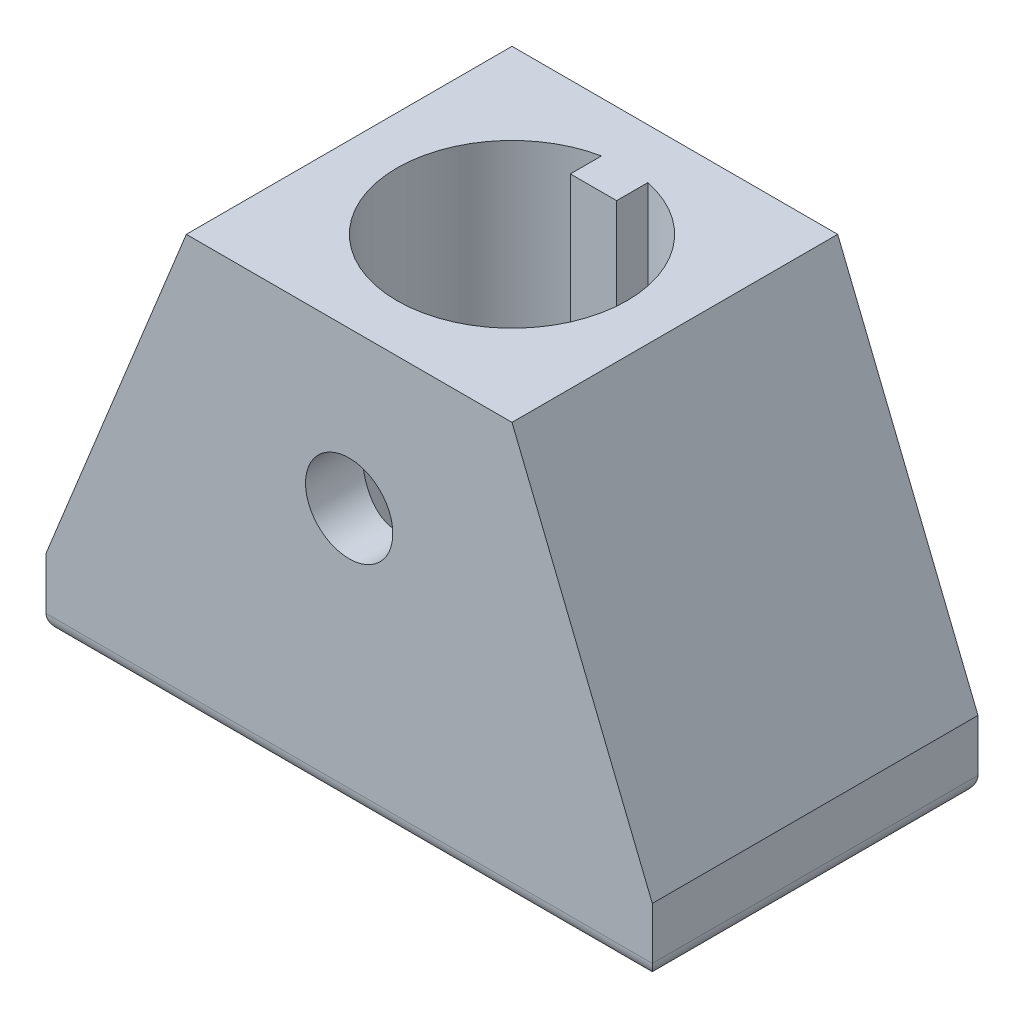
ISO-10303-21;
HEADER;
FILE_DESCRIPTION(('STEP AP214'),'2;1');
FILE_NAME('part.step','',(''),(''),'','','');
FILE_SCHEMA(('AUTOMOTIVE_DESIGN { 1 0 10303 214 1 1 1 1 }'));
ENDSEC;
DATA;
#1=APPLICATION_CONTEXT('core data for automotive mechanical design processes');
#2=APPLICATION_PROTOCOL_DEFINITION('international standard','automotive_design',2000,#1);
#3=PRODUCT_CONTEXT('',#1,'mechanical');
#4=PRODUCT('Part','Part','',(#3));
#5=PRODUCT_RELATED_PRODUCT_CATEGORY('part','',(#4));
#6=PRODUCT_DEFINITION_FORMATION('','',#4);
#7=PRODUCT_DEFINITION_CONTEXT('part definition',#1,'design');
#8=PRODUCT_DEFINITION('design','',#6,#7);
#9=PRODUCT_DEFINITION_SHAPE('','',#8);
#10=(LENGTH_UNIT() NAMED_UNIT(*) SI_UNIT(.MILLI.,.METRE.));
#11=(NAMED_UNIT(*) PLANE_ANGLE_UNIT() SI_UNIT($,.RADIAN.));
#12=(NAMED_UNIT(*) SI_UNIT($,.STERADIAN.) SOLID_ANGLE_UNIT());
#13=UNCERTAINTY_MEASURE_WITH_UNIT(LENGTH_MEASURE(1.E-05),#10,'distance_accuracy_value','');
#14=(GEOMETRIC_REPRESENTATION_CONTEXT(3) GLOBAL_UNCERTAINTY_ASSIGNED_CONTEXT((#13)) GLOBAL_UNIT_ASSIGNED_CONTEXT((#10,
#11,#12)) REPRESENTATION_CONTEXT('',''));
#15=CARTESIAN_POINT('',(0.,0.,0.));
#16=DIRECTION('',(0.,0.,1.));
#17=DIRECTION('',(1.,0.,0.));
#18=AXIS2_PLACEMENT_3D('',#15,#16,#17);
#19=CARTESIAN_POINT('',(-9.4,20.,9.4));
#20=DIRECTION('',(0.,0.,-1.));
#21=DIRECTION('',(-1.,0.,0.));
#22=AXIS2_PLACEMENT_3D('',#19,#20,#21);
#23=PLANE('',#22);
#24=DIRECTION('',(0.,1.,0.));
#25=VECTOR('',#24,1.);
#26=CARTESIAN_POINT('',(-17.5,-4.,9.4));
#27=LINE('',#26,#25);
#28=CARTESIAN_POINT('',(-17.5,-3.,9.4));
#29=VERTEX_POINT('',#28);
#30=CARTESIAN_POINT('',(-17.5,0.,9.4));
#31=VERTEX_POINT('',#30);
#32=EDGE_CURVE('E289',#29,#31,#27,.T.);
#33=ORIENTED_EDGE('',*,*,#32,.F.);
#34=DIRECTION('',(-1.,0.,0.));
#35=VECTOR('',#34,1.);
#36=CARTESIAN_POINT('',(17.5,-3.,9.4));
#37=LINE('',#36,#35);
#38=CARTESIAN_POINT('',(17.5,-3.,9.4));
#39=VERTEX_POINT('',#38);
#40=EDGE_CURVE('E189',#29,#39,#37,.F.);
#41=ORIENTED_EDGE('',*,*,#40,.T.);
#42=DIRECTION('',(0.,1.,0.));
#43=VECTOR('',#42,1.);
#44=CARTESIAN_POINT('',(17.5,-4.,9.4));
#45=LINE('',#44,#43);
#46=CARTESIAN_POINT('',(17.5,0.,9.4));
#47=VERTEX_POINT('',#46);
#48=EDGE_CURVE('E161',#39,#47,#45,.T.);
#49=ORIENTED_EDGE('',*,*,#48,.T.);
#50=DIRECTION('',(-0.375382367719639,0.926870043752196,0.));
#51=VECTOR('',#50,1.);
#52=CARTESIAN_POINT('',(17.5,0.,9.4));
#53=LINE('',#52,#51);
#54=CARTESIAN_POINT('',(9.4,20.,9.4));
#55=VERTEX_POINT('',#54);
#56=EDGE_CURVE('E143',#47,#55,#53,.T.);
#57=ORIENTED_EDGE('',*,*,#56,.T.);
#58=DIRECTION('',(1.,0.,0.));
#59=VECTOR('',#58,1.);
#60=CARTESIAN_POINT('',(-9.4,20.,9.4));
#61=LINE('',#60,#59);
#62=CARTESIAN_POINT('',(-9.4,20.,9.4));
#63=VERTEX_POINT('',#62);
#64=EDGE_CURVE('E159',#63,#55,#61,.T.);
#65=ORIENTED_EDGE('',*,*,#64,.F.);
#66=DIRECTION('',(-0.375382367719639,-0.926870043752196,0.));
#67=VECTOR('',#66,1.);
#68=CARTESIAN_POINT('',(-17.5,0.,9.4));
#69=LINE('',#68,#67);
#70=EDGE_CURVE('E280',#63,#31,#69,.T.);
#71=ORIENTED_EDGE('',*,*,#70,.T.);
#72=EDGE_LOOP('',(#33,#41,#49,#57,#65,#71));
#73=FACE_BOUND('',#72,.T.);
#74=CARTESIAN_POINT('',(-0.000284752947340119,11.0000000045047,9.4));
#75=DIRECTION('',(0.,0.,-1.));
#76=DIRECTION('',(-1.,0.,0.));
#77=AXIS2_PLACEMENT_3D('',#74,#75,#76);
#78=CIRCLE('',#77,2.52);
#79=CARTESIAN_POINT('',(-2.52028475294734,11.0000000045047,9.4));
#80=VERTEX_POINT('',#79);
#81=EDGE_CURVE('E302',#80,#80,#78,.F.);
#82=ORIENTED_EDGE('',*,*,#81,.F.);
#83=EDGE_LOOP('',(#82));
#84=FACE_BOUND('',#83,.T.);
#85=ADVANCED_FACE('F35',(#73,#84),#23,.F.);
#86=CARTESIAN_POINT('',(0.,20.,0.));
#87=DIRECTION('',(0.,-1.,0.));
#88=DIRECTION('',(0.,0.,-1.));
#89=AXIS2_PLACEMENT_3D('',#86,#87,#88);
#90=CYLINDRICAL_SURFACE('',#89,6.64);
#91=DIRECTION('',(0.,-1.,0.));
#92=VECTOR('',#91,1.);
#93=CARTESIAN_POINT('',(1.335,20.,-6.50441196419784));
#94=LINE('',#93,#92);
#95=CARTESIAN_POINT('',(1.335,20.,-6.50441196419784));
#96=VERTEX_POINT('',#95);
#97=CARTESIAN_POINT('',(1.335,-3.5,-6.50441196419784));
#98=VERTEX_POINT('',#97);
#99=EDGE_CURVE('E152',#96,#98,#94,.T.);
#100=ORIENTED_EDGE('',*,*,#99,.T.);
#101=CARTESIAN_POINT('',(0.,-3.5,0.));
#102=DIRECTION('',(0.,-1.,0.));
#103=DIRECTION('',(0.,0.,-1.));
#104=AXIS2_PLACEMENT_3D('',#101,#102,#103);
#105=CIRCLE('',#104,6.64);
#106=CARTESIAN_POINT('',(-1.335,-3.5,-6.50441196419784));
#107=VERTEX_POINT('',#106);
#108=EDGE_CURVE('E11',#98,#107,#105,.T.);
#109=ORIENTED_EDGE('',*,*,#108,.T.);
#110=DIRECTION('',(0.,-1.,0.));
#111=VECTOR('',#110,1.);
#112=CARTESIAN_POINT('',(-1.335,20.,-6.50441196419784));
#113=LINE('',#112,#111);
#114=CARTESIAN_POINT('',(-1.335,20.,-6.50441196419784));
#115=VERTEX_POINT('',#114);
#116=EDGE_CURVE('E257',#115,#107,#113,.T.);
#117=ORIENTED_EDGE('',*,*,#116,.F.);
#118=CARTESIAN_POINT('',(0.,20.,0.));
#119=DIRECTION('',(0.,1.,0.));
#120=DIRECTION('',(0.,0.,1.));
#121=AXIS2_PLACEMENT_3D('',#118,#119,#120);
#122=CIRCLE('',#121,6.64);
#123=EDGE_CURVE('E529',#115,#96,#122,.T.);
#124=ORIENTED_EDGE('',*,*,#123,.T.);
#125=EDGE_LOOP('',(#100,#109,#117,#124));
#126=FACE_BOUND('',#125,.T.);
#127=CARTESIAN_POINT('',(-2.52028475294734,11.0000000045047,6.14310709365067));
#128=CARTESIAN_POINT('',(-2.52029047436524,10.8640446649398,6.14310168116096));
#129=CARTESIAN_POINT('',(-2.50924598257201,10.7281264718398,6.14766985084493));
#130=CARTESIAN_POINT('',(-2.46556759092806,10.4603958995751,6.16531637953083));
#131=CARTESIAN_POINT('',(-2.43293473989054,10.3285833212756,6.17839432510735));
#132=CARTESIAN_POINT('',(-2.347455907598,10.0730081377871,6.21137021616661));
#133=CARTESIAN_POINT('',(-2.29465942566154,9.94922668087733,6.23125144805792));
#134=CARTESIAN_POINT('',(-2.17052800692802,9.71222959840261,6.27556673998264));
#135=CARTESIAN_POINT('',(-2.09918736040283,9.59901724166962,6.30000220160152));
#136=CARTESIAN_POINT('',(-1.93610034958335,9.38060414802114,6.35206745561263));
#137=CARTESIAN_POINT('',(-1.84356170263224,9.27601761802437,6.37979279248556));
#138=CARTESIAN_POINT('',(-1.64238546061537,9.08341339867792,6.43451844032847));
#139=CARTESIAN_POINT('',(-1.53374433138199,8.99539935630486,6.46151859059419));
#140=CARTESIAN_POINT('',(-1.29876392025242,8.8354585317613,6.5128913174252));
#141=CARTESIAN_POINT('',(-1.171938404274,8.76420236551793,6.53713890558189));
#142=CARTESIAN_POINT('',(-0.907016783390389,8.64429320897465,6.57912372363373));
#143=CARTESIAN_POINT('',(-0.768924709747952,8.59563217529799,6.5968632697778));
#144=CARTESIAN_POINT('',(-0.491847478090161,8.52445689496903,6.62315537567779));
#145=CARTESIAN_POINT('',(-0.35316988440796,8.50088485289899,6.63207835777529));
#146=CARTESIAN_POINT('',(-0.0735593358859178,8.4771645482362,6.6410637792264));
#147=CARTESIAN_POINT('',(0.067372851929452,8.47700848204299,6.64112917045713));
#148=CARTESIAN_POINT('',(0.339896577713276,8.49951499737163,6.63262609951339));
#149=CARTESIAN_POINT('',(0.471599595513978,8.52102187545034,6.62449490263314));
#150=CARTESIAN_POINT('',(0.729366177186854,8.58429602181112,6.60108944044233));
#151=CARTESIAN_POINT('',(0.855429340302803,8.62606472736649,6.58581466840481));
#152=CARTESIAN_POINT('',(1.10053354616205,8.72919794441172,6.54935236006117));
#153=CARTESIAN_POINT('',(1.21944463917043,8.79084060369502,6.52808147003131));
#154=CARTESIAN_POINT('',(1.44553274894429,8.93172328486938,6.48177231603739));
#155=CARTESIAN_POINT('',(1.55270591529138,9.01096905548827,6.45673282220669));
#156=CARTESIAN_POINT('',(1.75907076005023,9.19034362672784,6.40369385192596));
#157=CARTESIAN_POINT('',(1.8574022583045,9.29143764447063,6.37560691013937));
#158=CARTESIAN_POINT('',(2.03604550638843,9.50883901724008,6.32082820041548));
#159=CARTESIAN_POINT('',(2.11635250211243,9.62515037318559,6.29413680198442));
#160=CARTESIAN_POINT('',(2.25836705298908,9.87315903769088,6.24461244700843));
#161=CARTESIAN_POINT('',(2.31959942162997,10.0051509004667,6.22188347658501));
#162=CARTESIAN_POINT('',(2.41863950339309,10.2786630213718,6.18406234987488));
#163=CARTESIAN_POINT('',(2.45646062757047,10.4201777727332,6.16896582227811));
#164=CARTESIAN_POINT('',(2.50562434434263,10.7002041869143,6.14915556318602));
#165=CARTESIAN_POINT('',(2.51833645803392,10.8384371443967,6.14390565482604));
#166=CARTESIAN_POINT('',(2.52088014664838,11.115130488314,6.14286348956821));
#167=CARTESIAN_POINT('',(2.51071764065136,11.2535908066521,6.14706878602339));
#168=CARTESIAN_POINT('',(2.46904340856736,11.5196825711473,6.16391751914512));
#169=CARTESIAN_POINT('',(2.43860397122958,11.6475119700577,6.17613668628962));
#170=CARTESIAN_POINT('',(2.35859649083096,11.8961859816379,6.20712894689217));
#171=CARTESIAN_POINT('',(2.3090244717736,12.0170291364705,6.22590340254612));
#172=CARTESIAN_POINT('',(2.19003900803538,12.2534174644186,6.26876874739357));
#173=CARTESIAN_POINT('',(2.11994225024251,12.3685859864408,6.29303477357292));
#174=CARTESIAN_POINT('',(1.96261885311394,12.5860111926102,6.34385941883717));
#175=CARTESIAN_POINT('',(1.87538581515221,12.6882630302085,6.37041889220466));
#176=CARTESIAN_POINT('',(1.67953918034922,12.883869979695,6.42492975421866));
#177=CARTESIAN_POINT('',(1.56990245483635,12.9762104653506,6.45285900125334));
#178=CARTESIAN_POINT('',(1.33600703309177,13.1413106253951,6.50530792342082));
#179=CARTESIAN_POINT('',(1.21174820405657,13.2140701219223,6.5298275675819));
#180=CARTESIAN_POINT('',(0.952133490674127,13.3374956885485,6.57269189582122));
#181=CARTESIAN_POINT('',(0.816811660291642,13.3882267336531,6.59105470306003));
#182=CARTESIAN_POINT('',(0.538696665227733,13.4659109884755,6.61958484329715));
#183=CARTESIAN_POINT('',(0.395907142650147,13.4928756769219,6.62975613244834));
#184=CARTESIAN_POINT('',(0.116071039335942,13.5210018901135,6.64037386060305));
#185=CARTESIAN_POINT('',(-0.0208114220314374,13.5236038714073,6.64136315671084));
#186=CARTESIAN_POINT('',(-0.292981835898917,13.5066536740128,6.63492901367217));
#187=CARTESIAN_POINT('',(-0.428269986390403,13.4871042761483,6.62750663050498));
#188=CARTESIAN_POINT('',(-0.689907606623213,13.4274214992772,6.60533467760892));
#189=CARTESIAN_POINT('',(-0.816396950715605,13.3878247646749,6.59077643508212));
#190=CARTESIAN_POINT('',(-1.06094105528069,13.2897109203895,6.55585819202903));
#191=CARTESIAN_POINT('',(-1.17899421267176,13.2311902263031,6.53549709246547));
#192=CARTESIAN_POINT('',(-1.40881311097142,13.0940648781387,6.48992719049869));
#193=CARTESIAN_POINT('',(-1.52009846193188,13.0147124131703,6.46454914918437));
#194=CARTESIAN_POINT('',(-1.72821480003539,12.839345263364,6.41205214802003));
#195=CARTESIAN_POINT('',(-1.82504055488022,12.7433245740688,6.38493256303296));
#196=CARTESIAN_POINT('',(-2.00691416468882,12.5311434875359,6.33019816547186));
#197=CARTESIAN_POINT('',(-2.09103541701051,12.4141719356605,6.30263659680535));
#198=CARTESIAN_POINT('',(-2.23847692512118,12.1668848183366,6.25179381225867));
#199=CARTESIAN_POINT('',(-2.30179403978387,12.0365672417225,6.22851324298143));
#200=CARTESIAN_POINT('',(-2.40823321613177,11.7586115617299,6.18817135222931));
#201=CARTESIAN_POINT('',(-2.45007330170146,11.6104173468748,6.17151595671368));
#202=CARTESIAN_POINT('',(-2.50608605645808,11.3081300301299,6.14899070314063));
#203=CARTESIAN_POINT('',(-2.52027827042222,11.1540411738961,6.14311322615158));
#204=CARTESIAN_POINT('',(-2.52028475294734,11.0000000045047,6.14310709365067));
#205=B_SPLINE_CURVE_WITH_KNOTS('',3,(#127,#128,#129,#130,#131,#132,#133,#134,#135,#136,#137,
#138,#139,#140,#141,#142,#143,#144,#145,#146,#147,#148,#149,#150,#151,#152,#153,#154,#155,#156,
#157,#158,#159,#160,#161,#162,#163,#164,#165,#166,#167,#168,#169,#170,#171,#172,#173,#174,#175,
#176,#177,#178,#179,#180,#181,#182,#183,#184,#185,#186,#187,#188,#189,#190,#191,#192,#193,#194,
#195,#196,#197,#198,#199,#200,#201,#202,#203,#204),.UNSPECIFIED.,.T.,.F.,(4,2,2,2,2,2,2,2,2,2,2,
2,2,2,2,2,2,2,2,2,2,2,2,2,2,2,2,2,2,2,2,2,2,2,2,2,2,2,4),(0.,0.407292050661318,
0.814564315571181,1.22084313606826,1.62724719785242,2.05248043800041,2.47780714678583,
2.91801540794111,3.3580668441475,3.7787249263666,4.19924281989938,4.59845522470951,
4.99769595180445,5.40278628876793,5.80800911292079,6.23745708493392,6.66701819449607,
7.10655387668464,7.54583753870909,7.96041599953379,8.37488719558575,8.76901634729319,
9.16322744824607,9.57244116078241,9.98180796370202,10.4178633287811,10.8539226545862,
11.2886868976129,11.723241041977,12.1319270967551,12.5405618518837,12.9387945821834,
13.337102786306,13.7523376549382,14.1677224167891,14.6056918699569,15.0437274198737,
15.5055271795315,15.9670003660095),.UNSPECIFIED.);
#206=CARTESIAN_POINT('',(-2.52028475294734,11.0000000045047,6.14310709365067));
#207=VERTEX_POINT('',#206);
#208=EDGE_CURVE('E295',#207,#207,#205,.T.);
#209=ORIENTED_EDGE('',*,*,#208,.T.);
#210=EDGE_LOOP('',(#209));
#211=FACE_BOUND('',#210,.T.);
#212=ADVANCED_FACE('F304',(#126,#211),#90,.F.);
#213=CARTESIAN_POINT('',(0.,20.,0.));
#214=DIRECTION('',(0.,-1.,0.));
#215=DIRECTION('',(0.,0.,-1.));
#216=AXIS2_PLACEMENT_3D('',#213,#214,#215);
#217=PLANE('',#216);
#218=DIRECTION('',(0.,0.,-1.));
#219=VECTOR('',#218,1.);
#220=CARTESIAN_POINT('',(9.4,20.,9.4));
#221=LINE('',#220,#219);
#222=CARTESIAN_POINT('',(9.4,20.,-9.4));
#223=VERTEX_POINT('',#222);
#224=EDGE_CURVE('E139',#55,#223,#221,.T.);
#225=ORIENTED_EDGE('',*,*,#224,.T.);
#226=DIRECTION('',(-1.,0.,0.));
#227=VECTOR('',#226,1.);
#228=CARTESIAN_POINT('',(-9.4,20.,-9.4));
#229=LINE('',#228,#227);
#230=CARTESIAN_POINT('',(-9.4,20.,-9.4));
#231=VERTEX_POINT('',#230);
#232=EDGE_CURVE('E151',#223,#231,#229,.T.);
#233=ORIENTED_EDGE('',*,*,#232,.T.);
#234=DIRECTION('',(0.,0.,1.));
#235=VECTOR('',#234,1.);
#236=CARTESIAN_POINT('',(-9.4,20.,9.4));
#237=LINE('',#236,#235);
#238=EDGE_CURVE('E168',#231,#63,#237,.T.);
#239=ORIENTED_EDGE('',*,*,#238,.T.);
#240=ORIENTED_EDGE('',*,*,#64,.T.);
#241=EDGE_LOOP('',(#225,#233,#239,#240));
#242=FACE_BOUND('',#241,.T.);
#243=ORIENTED_EDGE('',*,*,#123,.F.);
#244=DIRECTION('',(0.,0.,-1.));
#245=VECTOR('',#244,1.);
#246=CARTESIAN_POINT('',(-1.335,20.,-6.50441196419784));
#247=LINE('',#246,#245);
#248=CARTESIAN_POINT('',(-1.335,20.,-4.70441196419784));
#249=VERTEX_POINT('',#248);
#250=EDGE_CURVE('E265',#249,#115,#247,.T.);
#251=ORIENTED_EDGE('',*,*,#250,.F.);
#252=DIRECTION('',(-1.,0.,0.));
#253=VECTOR('',#252,1.);
#254=CARTESIAN_POINT('',(-1.335,20.,-4.70441196419784));
#255=LINE('',#254,#253);
#256=CARTESIAN_POINT('',(1.335,20.,-4.70441196419784));
#257=VERTEX_POINT('',#256);
#258=EDGE_CURVE('E260',#257,#249,#255,.T.);
#259=ORIENTED_EDGE('',*,*,#258,.F.);
#260=DIRECTION('',(0.,0.,1.));
#261=VECTOR('',#260,1.);
#262=CARTESIAN_POINT('',(1.335,20.,-4.70441196419784));
#263=LINE('',#262,#261);
#264=EDGE_CURVE('E531',#96,#257,#263,.T.);
#265=ORIENTED_EDGE('',*,*,#264,.F.);
#266=EDGE_LOOP('',(#243,#251,#259,#265));
#267=FACE_BOUND('',#266,.T.);
#268=ADVANCED_FACE('F165',(#242,#267),#217,.F.);
#269=CARTESIAN_POINT('',(-9.4,20.,-9.4));
#270=DIRECTION('',(0.,0.,1.));
#271=DIRECTION('',(1.,0.,0.));
#272=AXIS2_PLACEMENT_3D('',#269,#270,#271);
#273=PLANE('',#272);
#274=DIRECTION('',(0.,1.,0.));
#275=VECTOR('',#274,1.);
#276=CARTESIAN_POINT('',(17.5,-4.,-9.4));
#277=LINE('',#276,#275);
#278=CARTESIAN_POINT('',(17.5,-3.,-9.4));
#279=VERTEX_POINT('',#278);
#280=CARTESIAN_POINT('',(17.5,0.,-9.4));
#281=VERTEX_POINT('',#280);
#282=EDGE_CURVE('E292',#279,#281,#277,.T.);
#283=ORIENTED_EDGE('',*,*,#282,.F.);
#284=DIRECTION('',(1.,0.,0.));
#285=VECTOR('',#284,1.);
#286=CARTESIAN_POINT('',(-17.5,-3.,-9.4));
#287=LINE('',#286,#285);
#288=CARTESIAN_POINT('',(-17.5,-3.,-9.4));
#289=VERTEX_POINT('',#288);
#290=EDGE_CURVE('E185',#279,#289,#287,.F.);
#291=ORIENTED_EDGE('',*,*,#290,.T.);
#292=DIRECTION('',(0.,1.,0.));
#293=VECTOR('',#292,1.);
#294=CARTESIAN_POINT('',(-17.5,-4.,-9.4));
#295=LINE('',#294,#293);
#296=CARTESIAN_POINT('',(-17.5,0.,-9.4));
#297=VERTEX_POINT('',#296);
#298=EDGE_CURVE('E275',#289,#297,#295,.T.);
#299=ORIENTED_EDGE('',*,*,#298,.T.);
#300=DIRECTION('',(0.375382367719639,0.926870043752196,0.));
#301=VECTOR('',#300,1.);
#302=CARTESIAN_POINT('',(-17.5,0.,-9.4));
#303=LINE('',#302,#301);
#304=EDGE_CURVE('E273',#297,#231,#303,.T.);
#305=ORIENTED_EDGE('',*,*,#304,.T.);
#306=ORIENTED_EDGE('',*,*,#232,.F.);
#307=DIRECTION('',(0.375382367719639,-0.926870043752196,0.));
#308=VECTOR('',#307,1.);
#309=CARTESIAN_POINT('',(17.5,0.,-9.4));
#310=LINE('',#309,#308);
#311=EDGE_CURVE('E146',#223,#281,#310,.T.);
#312=ORIENTED_EDGE('',*,*,#311,.T.);
#313=EDGE_LOOP('',(#283,#291,#299,#305,#306,#312));
#314=FACE_BOUND('',#313,.T.);
#315=ADVANCED_FACE('F271',(#314),#273,.F.);
#316=CARTESIAN_POINT('',(1.335,20.,-4.70441196419784));
#317=DIRECTION('',(1.,0.,0.));
#318=DIRECTION('',(0.,0.,-1.));
#319=AXIS2_PLACEMENT_3D('',#316,#317,#318);
#320=PLANE('',#319);
#321=DIRECTION('',(0.,-1.,0.));
#322=VECTOR('',#321,1.);
#323=CARTESIAN_POINT('',(1.335,20.,-4.70441196419784));
#324=LINE('',#323,#322);
#325=CARTESIAN_POINT('',(1.335,-3.5,-4.70441196419784));
#326=VERTEX_POINT('',#325);
#327=EDGE_CURVE('E262',#257,#326,#324,.T.);
#328=ORIENTED_EDGE('',*,*,#327,.T.);
#329=DIRECTION('',(0.,0.,1.));
#330=VECTOR('',#329,1.);
#331=CARTESIAN_POINT('',(1.335,-3.5,-4.70441196419784));
#332=LINE('',#331,#330);
#333=EDGE_CURVE('E44',#326,#98,#332,.F.);
#334=ORIENTED_EDGE('',*,*,#333,.T.);
#335=ORIENTED_EDGE('',*,*,#99,.F.);
#336=ORIENTED_EDGE('',*,*,#264,.T.);
#337=EDGE_LOOP('',(#328,#334,#335,#336));
#338=FACE_BOUND('',#337,.T.);
#339=ADVANCED_FACE('F319',(#338),#320,.T.);
#340=CARTESIAN_POINT('',(-1.335,20.,-4.70441196419784));
#341=DIRECTION('',(0.,0.,1.));
#342=DIRECTION('',(1.,0.,0.));
#343=AXIS2_PLACEMENT_3D('',#340,#341,#342);
#344=PLANE('',#343);
#345=DIRECTION('',(0.,-1.,0.));
#346=VECTOR('',#345,1.);
#347=CARTESIAN_POINT('',(-1.335,20.,-4.70441196419784));
#348=LINE('',#347,#346);
#349=CARTESIAN_POINT('',(-1.335,-3.5,-4.70441196419784));
#350=VERTEX_POINT('',#349);
#351=EDGE_CURVE('E254',#249,#350,#348,.T.);
#352=ORIENTED_EDGE('',*,*,#351,.T.);
#353=DIRECTION('',(-1.,0.,0.));
#354=VECTOR('',#353,1.);
#355=CARTESIAN_POINT('',(-1.335,-3.5,-4.70441196419784));
#356=LINE('',#355,#354);
#357=EDGE_CURVE('E59',#350,#326,#356,.F.);
#358=ORIENTED_EDGE('',*,*,#357,.T.);
#359=ORIENTED_EDGE('',*,*,#327,.F.);
#360=ORIENTED_EDGE('',*,*,#258,.T.);
#361=EDGE_LOOP('',(#352,#358,#359,#360));
#362=FACE_BOUND('',#361,.T.);
#363=ADVANCED_FACE('F258',(#362),#344,.T.);
#364=CARTESIAN_POINT('',(-1.335,20.,-6.50441196419784));
#365=DIRECTION('',(-1.,0.,0.));
#366=DIRECTION('',(0.,0.,1.));
#367=AXIS2_PLACEMENT_3D('',#364,#365,#366);
#368=PLANE('',#367);
#369=ORIENTED_EDGE('',*,*,#116,.T.);
#370=DIRECTION('',(0.,0.,-1.));
#371=VECTOR('',#370,1.);
#372=CARTESIAN_POINT('',(-1.335,-3.5,-6.50441196419784));
#373=LINE('',#372,#371);
#374=EDGE_CURVE('E209',#107,#350,#373,.F.);
#375=ORIENTED_EDGE('',*,*,#374,.T.);
#376=ORIENTED_EDGE('',*,*,#351,.F.);
#377=ORIENTED_EDGE('',*,*,#250,.T.);
#378=EDGE_LOOP('',(#369,#375,#376,#377));
#379=FACE_BOUND('',#378,.T.);
#380=ADVANCED_FACE('F253',(#379),#368,.T.);
#381=CARTESIAN_POINT('',(-0.000284752947340119,11.0000000045047,10.2955880358022));
#382=DIRECTION('',(0.,0.,-1.));
#383=DIRECTION('',(-1.,0.,0.));
#384=AXIS2_PLACEMENT_3D('',#381,#382,#383);
#385=CYLINDRICAL_SURFACE('',#384,2.52);
#386=ORIENTED_EDGE('',*,*,#208,.F.);
#387=EDGE_LOOP('',(#386));
#388=FACE_BOUND('',#387,.T.);
#389=ORIENTED_EDGE('',*,*,#81,.T.);
#390=EDGE_LOOP('',(#389));
#391=FACE_BOUND('',#390,.T.);
#392=ADVANCED_FACE('F308',(#388,#391),#385,.F.);
#393=CARTESIAN_POINT('',(-17.5,-4.,-9.4));
#394=DIRECTION('',(1.,0.,0.));
#395=DIRECTION('',(0.,0.,-1.));
#396=AXIS2_PLACEMENT_3D('',#393,#394,#395);
#397=PLANE('',#396);
#398=ORIENTED_EDGE('',*,*,#298,.F.);
#399=DIRECTION('',(0.,0.,-1.));
#400=VECTOR('',#399,1.);
#401=CARTESIAN_POINT('',(-17.5,-3.,9.4));
#402=LINE('',#401,#400);
#403=EDGE_CURVE('E187',#289,#29,#402,.F.);
#404=ORIENTED_EDGE('',*,*,#403,.T.);
#405=ORIENTED_EDGE('',*,*,#32,.T.);
#406=DIRECTION('',(0.,0.,-1.));
#407=VECTOR('',#406,1.);
#408=CARTESIAN_POINT('',(-17.5,0.,-9.4));
#409=LINE('',#408,#407);
#410=EDGE_CURVE('E279',#31,#297,#409,.T.);
#411=ORIENTED_EDGE('',*,*,#410,.T.);
#412=EDGE_LOOP('',(#398,#404,#405,#411));
#413=FACE_BOUND('',#412,.T.);
#414=ADVANCED_FACE('F313',(#413),#397,.F.);
#415=CARTESIAN_POINT('',(17.5,-4.,-9.4));
#416=DIRECTION('',(-1.,0.,0.));
#417=DIRECTION('',(0.,0.,1.));
#418=AXIS2_PLACEMENT_3D('',#415,#416,#417);
#419=PLANE('',#418);
#420=ORIENTED_EDGE('',*,*,#48,.F.);
#421=DIRECTION('',(0.,0.,1.));
#422=VECTOR('',#421,1.);
#423=CARTESIAN_POINT('',(17.5,-3.,-9.4));
#424=LINE('',#423,#422);
#425=EDGE_CURVE('E182',#39,#279,#424,.F.);
#426=ORIENTED_EDGE('',*,*,#425,.T.);
#427=ORIENTED_EDGE('',*,*,#282,.T.);
#428=DIRECTION('',(0.,0.,1.));
#429=VECTOR('',#428,1.);
#430=CARTESIAN_POINT('',(17.5,0.,-9.4));
#431=LINE('',#430,#429);
#432=EDGE_CURVE('E287',#281,#47,#431,.T.);
#433=ORIENTED_EDGE('',*,*,#432,.T.);
#434=EDGE_LOOP('',(#420,#426,#427,#433));
#435=FACE_BOUND('',#434,.T.);
#436=ADVANCED_FACE('F358',(#435),#419,.F.);
#437=CARTESIAN_POINT('',(0.,-4.,0.));
#438=DIRECTION('',(0.,-1.,0.));
#439=DIRECTION('',(0.,0.,-1.));
#440=AXIS2_PLACEMENT_3D('',#437,#438,#439);
#441=PLANE('',#440);
#442=DIRECTION('',(-1.,0.,0.));
#443=VECTOR('',#442,1.);
#444=CARTESIAN_POINT('',(0.,-4.,-5.20441196419784));
#445=LINE('',#444,#443);
#446=CARTESIAN_POINT('',(0.835,-4.,-5.20441196419784));
#447=VERTEX_POINT('',#446);
#448=CARTESIAN_POINT('',(-0.835,-4.,-5.20441196419784));
#449=VERTEX_POINT('',#448);
#450=EDGE_CURVE('E204',#447,#449,#445,.T.);
#451=ORIENTED_EDGE('',*,*,#450,.T.);
#452=DIRECTION('',(0.,0.,-1.));
#453=VECTOR('',#452,1.);
#454=CARTESIAN_POINT('',(-0.835,-4.,0.));
#455=LINE('',#454,#453);
#456=CARTESIAN_POINT('',(-0.835,-4.,-7.09100662811706));
#457=VERTEX_POINT('',#456);
#458=EDGE_CURVE('E206',#449,#457,#455,.T.);
#459=ORIENTED_EDGE('',*,*,#458,.T.);
#460=CARTESIAN_POINT('',(0.,-4.,0.));
#461=DIRECTION('',(0.,-1.,0.));
#462=DIRECTION('',(0.,0.,-1.));
#463=AXIS2_PLACEMENT_3D('',#460,#461,#462);
#464=CIRCLE('',#463,7.14);
#465=CARTESIAN_POINT('',(0.835,-4.,-7.09100662811706));
#466=VERTEX_POINT('',#465);
#467=EDGE_CURVE('E191',#457,#466,#464,.F.);
#468=ORIENTED_EDGE('',*,*,#467,.T.);
#469=DIRECTION('',(0.,0.,1.));
#470=VECTOR('',#469,1.);
#471=CARTESIAN_POINT('',(0.835,-4.,0.));
#472=LINE('',#471,#470);
#473=EDGE_CURVE('E202',#466,#447,#472,.T.);
#474=ORIENTED_EDGE('',*,*,#473,.T.);
#475=EDGE_LOOP('',(#451,#459,#468,#474));
#476=FACE_BOUND('',#475,.T.);
#477=DIRECTION('',(1.,0.,0.));
#478=VECTOR('',#477,1.);
#479=CARTESIAN_POINT('',(17.5,-4.,-8.4));
#480=LINE('',#479,#478);
#481=CARTESIAN_POINT('',(-16.5,-4.,-8.4));
#482=VERTEX_POINT('',#481);
#483=CARTESIAN_POINT('',(16.5,-4.,-8.4));
#484=VERTEX_POINT('',#483);
#485=EDGE_CURVE('E177',#482,#484,#480,.T.);
#486=ORIENTED_EDGE('',*,*,#485,.T.);
#487=DIRECTION('',(0.,0.,1.));
#488=VECTOR('',#487,1.);
#489=CARTESIAN_POINT('',(16.5,-4.,9.4));
#490=LINE('',#489,#488);
#491=CARTESIAN_POINT('',(16.5,-4.,8.4));
#492=VERTEX_POINT('',#491);
#493=EDGE_CURVE('E179',#484,#492,#490,.T.);
#494=ORIENTED_EDGE('',*,*,#493,.T.);
#495=DIRECTION('',(-1.,0.,0.));
#496=VECTOR('',#495,1.);
#497=CARTESIAN_POINT('',(-17.5,-4.,8.4));
#498=LINE('',#497,#496);
#499=CARTESIAN_POINT('',(-16.5,-4.,8.4));
#500=VERTEX_POINT('',#499);
#501=EDGE_CURVE('E169',#492,#500,#498,.T.);
#502=ORIENTED_EDGE('',*,*,#501,.T.);
#503=DIRECTION('',(0.,0.,-1.));
#504=VECTOR('',#503,1.);
#505=CARTESIAN_POINT('',(-16.5,-4.,-9.4));
#506=LINE('',#505,#504);
#507=EDGE_CURVE('E171',#500,#482,#506,.T.);
#508=ORIENTED_EDGE('',*,*,#507,.T.);
#509=EDGE_LOOP('',(#486,#494,#502,#508));
#510=FACE_BOUND('',#509,.T.);
#511=ADVANCED_FACE('F368',(#476,#510),#441,.T.);
#512=CARTESIAN_POINT('',(-17.5,0.,-30.977998053573));
#513=DIRECTION('',(-0.926870043752196,0.375382367719639,0.));
#514=DIRECTION('',(-0.375382367719639,-0.926870043752196,0.));
#515=AXIS2_PLACEMENT_3D('',#512,#513,#514);
#516=PLANE('',#515);
#517=ORIENTED_EDGE('',*,*,#304,.F.);
#518=ORIENTED_EDGE('',*,*,#410,.F.);
#519=ORIENTED_EDGE('',*,*,#70,.F.);
#520=ORIENTED_EDGE('',*,*,#238,.F.);
#521=EDGE_LOOP('',(#517,#518,#519,#520));
#522=FACE_BOUND('',#521,.T.);
#523=ADVANCED_FACE('F282',(#522),#516,.T.);
#524=CARTESIAN_POINT('',(17.5,0.,-30.977998053573));
#525=DIRECTION('',(0.926870043752196,0.375382367719639,0.));
#526=DIRECTION('',(-0.375382367719639,0.926870043752196,0.));
#527=AXIS2_PLACEMENT_3D('',#524,#525,#526);
#528=PLANE('',#527);
#529=ORIENTED_EDGE('',*,*,#311,.F.);
#530=ORIENTED_EDGE('',*,*,#224,.F.);
#531=ORIENTED_EDGE('',*,*,#56,.F.);
#532=ORIENTED_EDGE('',*,*,#432,.F.);
#533=EDGE_LOOP('',(#529,#530,#531,#532));
#534=FACE_BOUND('',#533,.T.);
#535=ADVANCED_FACE('F141',(#534),#528,.T.);
#536=CARTESIAN_POINT('',(-16.5,-3.,0.));
#537=DIRECTION('',(0.,0.,1.));
#538=DIRECTION('',(1.,0.,0.));
#539=AXIS2_PLACEMENT_3D('',#536,#537,#538);
#540=CYLINDRICAL_SURFACE('',#539,1.);
#541=CARTESIAN_POINT('',(-16.5,-3.,8.4));
#542=DIRECTION('',(0.707106781186547,0.,0.707106781186547));
#543=DIRECTION('',(0.707106781186547,0.,-0.707106781186547));
#544=AXIS2_PLACEMENT_3D('',#541,#542,#543);
#545=ELLIPSE('',#544,1.41421356237309,1.);
#546=EDGE_CURVE('E196',#29,#500,#545,.T.);
#547=ORIENTED_EDGE('',*,*,#546,.F.);
#548=ORIENTED_EDGE('',*,*,#403,.F.);
#549=CARTESIAN_POINT('',(-16.5,-3.,-8.4));
#550=DIRECTION('',(-0.707106781186547,0.,0.707106781186547));
#551=DIRECTION('',(0.707106781186547,0.,0.707106781186547));
#552=AXIS2_PLACEMENT_3D('',#549,#550,#551);
#553=ELLIPSE('',#552,1.41421356237309,1.);
#554=EDGE_CURVE('E162',#482,#289,#553,.F.);
#555=ORIENTED_EDGE('',*,*,#554,.F.);
#556=ORIENTED_EDGE('',*,*,#507,.F.);
#557=EDGE_LOOP('',(#547,#548,#555,#556));
#558=FACE_BOUND('',#557,.T.);
#559=ADVANCED_FACE('F341',(#558),#540,.T.);
#560=CARTESIAN_POINT('',(0.,-3.,-8.4));
#561=DIRECTION('',(-1.,0.,0.));
#562=DIRECTION('',(0.,0.,1.));
#563=AXIS2_PLACEMENT_3D('',#560,#561,#562);
#564=CYLINDRICAL_SURFACE('',#563,1.);
#565=ORIENTED_EDGE('',*,*,#554,.T.);
#566=ORIENTED_EDGE('',*,*,#290,.F.);
#567=CARTESIAN_POINT('',(16.5,-3.,-8.4));
#568=DIRECTION('',(-0.707106781186547,0.,-0.707106781186547));
#569=DIRECTION('',(-0.707106781186547,0.,0.707106781186547));
#570=AXIS2_PLACEMENT_3D('',#567,#568,#569);
#571=ELLIPSE('',#570,1.41421356237309,1.);
#572=EDGE_CURVE('E194',#484,#279,#571,.F.);
#573=ORIENTED_EDGE('',*,*,#572,.F.);
#574=ORIENTED_EDGE('',*,*,#485,.F.);
#575=EDGE_LOOP('',(#565,#566,#573,#574));
#576=FACE_BOUND('',#575,.T.);
#577=ADVANCED_FACE('F338',(#576),#564,.T.);
#578=CARTESIAN_POINT('',(0.,-3.,8.4));
#579=DIRECTION('',(1.,0.,0.));
#580=DIRECTION('',(0.,0.,-1.));
#581=AXIS2_PLACEMENT_3D('',#578,#579,#580);
#582=CYLINDRICAL_SURFACE('',#581,1.);
#583=ORIENTED_EDGE('',*,*,#546,.T.);
#584=ORIENTED_EDGE('',*,*,#501,.F.);
#585=CARTESIAN_POINT('',(16.5,-3.,8.4));
#586=DIRECTION('',(0.707106781186547,0.,-0.707106781186547));
#587=DIRECTION('',(0.707106781186547,0.,0.707106781186547));
#588=AXIS2_PLACEMENT_3D('',#585,#586,#587);
#589=ELLIPSE('',#588,1.41421356237309,1.);
#590=EDGE_CURVE('E192',#39,#492,#589,.T.);
#591=ORIENTED_EDGE('',*,*,#590,.F.);
#592=ORIENTED_EDGE('',*,*,#40,.F.);
#593=EDGE_LOOP('',(#583,#584,#591,#592));
#594=FACE_BOUND('',#593,.T.);
#595=ADVANCED_FACE('F334',(#594),#582,.T.);
#596=CARTESIAN_POINT('',(16.5,-3.,0.));
#597=DIRECTION('',(0.,0.,-1.));
#598=DIRECTION('',(-1.,0.,0.));
#599=AXIS2_PLACEMENT_3D('',#596,#597,#598);
#600=CYLINDRICAL_SURFACE('',#599,1.);
#601=ORIENTED_EDGE('',*,*,#572,.T.);
#602=ORIENTED_EDGE('',*,*,#425,.F.);
#603=ORIENTED_EDGE('',*,*,#590,.T.);
#604=ORIENTED_EDGE('',*,*,#493,.F.);
#605=EDGE_LOOP('',(#601,#602,#603,#604));
#606=FACE_BOUND('',#605,.T.);
#607=ADVANCED_FACE('F232',(#606),#600,.T.);
#608=CARTESIAN_POINT('',(0.835,-3.5,0.));
#609=DIRECTION('',(0.,0.,1.));
#610=DIRECTION('',(1.,0.,0.));
#611=AXIS2_PLACEMENT_3D('',#608,#609,#610);
#612=CYLINDRICAL_SURFACE('',#611,0.5);
#613=CARTESIAN_POINT('',(1.335,-3.5,-6.50441196419784));
#614=CARTESIAN_POINT('',(1.3350390104433,-3.5212256890873,-6.50436214812566));
#615=CARTESIAN_POINT('',(1.33365116250125,-3.54237338529058,-6.50606586997181));
#616=CARTESIAN_POINT('',(1.3283776066141,-3.58363940938797,-6.51252783974816));
#617=CARTESIAN_POINT('',(1.32452029814043,-3.60376666801826,-6.51725135834005));
#618=CARTESIAN_POINT('',(1.31467013262999,-3.64254589892404,-6.52929321410601));
#619=CARTESIAN_POINT('',(1.30868621268588,-3.66120365190492,-6.53660069154815));
#620=CARTESIAN_POINT('',(1.29498575437063,-3.69692573993988,-6.55329481110392));
#621=CARTESIAN_POINT('',(1.28726398799454,-3.71398504232672,-6.56268772571332));
#622=CARTESIAN_POINT('',(1.26608979387123,-3.75481883274049,-6.58837841070028));
#623=CARTESIAN_POINT('',(1.25174629148756,-3.77746805275804,-6.60572573683859));
#624=CARTESIAN_POINT('',(1.22090956024263,-3.81897439585307,-6.64285072857966));
#625=CARTESIAN_POINT('',(1.20441163444033,-3.83782299773537,-6.66263369867021));
#626=CARTESIAN_POINT('',(1.16107824419565,-3.88082150667761,-6.71434201291019));
#627=CARTESIAN_POINT('',(1.13327372725974,-3.90274690854883,-6.74729958389709));
#628=CARTESIAN_POINT('',(1.07557121577472,-3.93965805757858,-6.81516134102646));
#629=CARTESIAN_POINT('',(1.04567022626676,-3.95463363393717,-6.85006829690541));
#630=CARTESIAN_POINT('',(0.986407212978914,-3.97751654395575,-6.91870921101608));
#631=CARTESIAN_POINT('',(0.957120940249672,-3.98579482871761,-6.95238744338681));
#632=CARTESIAN_POINT('',(0.897915600621092,-3.99693681644455,-7.01997221260294));
#633=CARTESIAN_POINT('',(0.867998058521053,-3.99981232718181,-7.05387808866803));
#634=CARTESIAN_POINT('',(0.836987755937483,-3.99999702949171,-7.08877080799438));
#635=CARTESIAN_POINT('',(0.835993927738724,-3.99999999266758,-7.08988879511266));
#636=CARTESIAN_POINT('',(0.835,-4.,-7.09100662811706));
#637=B_SPLINE_CURVE_WITH_KNOTS('',3,(#613,#614,#615,#616,#617,#618,#619,#620,#621,#622,#623,
#624,#625,#626,#627,#628,#629,#630,#631,#632,#633,#634,#635,#636),.UNSPECIFIED.,.F.,.F.,(4,2,2,
2,2,2,2,2,2,2,2,4),(0.,0.0634400362613162,0.126163289430309,0.188626005735228,0.251279203279725,
0.346536647276597,0.442005345384991,0.58633850323001,0.730882226079211,0.866732240211926,
1.00228500698108,1.00677257468441),.UNSPECIFIED.);
#638=EDGE_CURVE('E234',#98,#466,#637,.T.);
#639=ORIENTED_EDGE('',*,*,#638,.F.);
#640=ORIENTED_EDGE('',*,*,#333,.F.);
#641=CARTESIAN_POINT('',(0.835,-3.5,-5.20441196419784));
#642=DIRECTION('',(-0.707106781186547,0.,0.707106781186547));
#643=DIRECTION('',(0.707106781186547,0.,0.707106781186547));
#644=AXIS2_PLACEMENT_3D('',#641,#642,#643);
#645=ELLIPSE('',#644,0.707106781186547,0.5);
#646=EDGE_CURVE('E39',#447,#326,#645,.T.);
#647=ORIENTED_EDGE('',*,*,#646,.F.);
#648=ORIENTED_EDGE('',*,*,#473,.F.);
#649=EDGE_LOOP('',(#639,#640,#647,#648));
#650=FACE_BOUND('',#649,.T.);
#651=ADVANCED_FACE('F229',(#650),#612,.T.);
#652=CARTESIAN_POINT('',(0.,-3.5,-5.20441196419784));
#653=DIRECTION('',(-1.,0.,0.));
#654=DIRECTION('',(0.,0.,1.));
#655=AXIS2_PLACEMENT_3D('',#652,#653,#654);
#656=CYLINDRICAL_SURFACE('',#655,0.5);
#657=ORIENTED_EDGE('',*,*,#646,.T.);
#658=ORIENTED_EDGE('',*,*,#357,.F.);
#659=CARTESIAN_POINT('',(-0.835,-3.5,-5.20441196419784));
#660=DIRECTION('',(-0.707106781186548,0.,-0.707106781186547));
#661=DIRECTION('',(-0.707106781186547,0.,0.707106781186548));
#662=AXIS2_PLACEMENT_3D('',#659,#660,#661);
#663=ELLIPSE('',#662,0.707106781186547,0.5);
#664=EDGE_CURVE('E221',#449,#350,#663,.T.);
#665=ORIENTED_EDGE('',*,*,#664,.F.);
#666=ORIENTED_EDGE('',*,*,#450,.F.);
#667=EDGE_LOOP('',(#657,#658,#665,#666));
#668=FACE_BOUND('',#667,.T.);
#669=ADVANCED_FACE('F37',(#668),#656,.T.);
#670=CARTESIAN_POINT('',(0.,-3.5,0.));
#671=DIRECTION('',(0.,-1.,0.));
#672=DIRECTION('',(0.,0.,-1.));
#673=AXIS2_PLACEMENT_3D('',#670,#671,#672);
#674=TOROIDAL_SURFACE('',#673,7.14,0.5);
#675=ORIENTED_EDGE('',*,*,#638,.T.);
#676=ORIENTED_EDGE('',*,*,#467,.F.);
#677=CARTESIAN_POINT('',(-1.335,-3.5,-6.50441196419784));
#678=CARTESIAN_POINT('',(-1.3350390104433,-3.5212256890873,-6.50436214812566));
#679=CARTESIAN_POINT('',(-1.33365116250125,-3.54237338529057,-6.50606586997181));
#680=CARTESIAN_POINT('',(-1.3283776066141,-3.58363940938797,-6.51252783974816));
#681=CARTESIAN_POINT('',(-1.32452029814043,-3.60376666801826,-6.51725135834005));
#682=CARTESIAN_POINT('',(-1.31467013262999,-3.64254589892404,-6.529293214106));
#683=CARTESIAN_POINT('',(-1.30868621268588,-3.66120365190492,-6.53660069154815));
#684=CARTESIAN_POINT('',(-1.29498575437063,-3.69692573993988,-6.55329481110392));
#685=CARTESIAN_POINT('',(-1.28726398799454,-3.71398504232672,-6.56268772571332));
#686=CARTESIAN_POINT('',(-1.26608979387123,-3.75481883274049,-6.58837841070028));
#687=CARTESIAN_POINT('',(-1.25174629148756,-3.77746805275804,-6.60572573683859));
#688=CARTESIAN_POINT('',(-1.22090956024263,-3.81897439585307,-6.64285072857966));
#689=CARTESIAN_POINT('',(-1.20441163444033,-3.83782299773537,-6.66263369867021));
#690=CARTESIAN_POINT('',(-1.16107824419565,-3.88082150667761,-6.71434201291019));
#691=CARTESIAN_POINT('',(-1.13327372725974,-3.90274690854883,-6.74729958389709));
#692=CARTESIAN_POINT('',(-1.07557121577472,-3.93965805757858,-6.81516134102646));
#693=CARTESIAN_POINT('',(-1.04567022626677,-3.95463363393717,-6.85006829690541));
#694=CARTESIAN_POINT('',(-0.98640721297891,-3.97751654395574,-6.91870921101607));
#695=CARTESIAN_POINT('',(-0.957120940249656,-3.98579482871761,-6.9523874433868));
#696=CARTESIAN_POINT('',(-0.897915600621108,-3.99693681644455,-7.01997221260295));
#697=CARTESIAN_POINT('',(-0.867998058521114,-3.99981232718181,-7.05387808866808));
#698=CARTESIAN_POINT('',(-0.836987755937487,-3.99999702949171,-7.08877080799438));
#699=CARTESIAN_POINT('',(-0.835993927738726,-3.99999999266758,-7.08988879511267));
#700=CARTESIAN_POINT('',(-0.835,-4.,-7.09100662811706));
#701=B_SPLINE_CURVE_WITH_KNOTS('',3,(#677,#678,#679,#680,#681,#682,#683,#684,#685,#686,#687,
#688,#689,#690,#691,#692,#693,#694,#695,#696,#697,#698,#699,#700),.UNSPECIFIED.,.F.,.F.,(4,2,2,
2,2,2,2,2,2,2,2,4),(0.,0.0634400362613162,0.126163289430309,0.188626005735228,0.251279203279725,
0.346536647276598,0.442005345384991,0.586338503230008,0.730882226079209,0.866732240211927,
1.00228500698108,1.00677257468441),.UNSPECIFIED.);
#702=EDGE_CURVE('E214',#107,#457,#701,.T.);
#703=ORIENTED_EDGE('',*,*,#702,.F.);
#704=ORIENTED_EDGE('',*,*,#108,.F.);
#705=EDGE_LOOP('',(#675,#676,#703,#704));
#706=FACE_BOUND('',#705,.T.);
#707=ADVANCED_FACE('F222',(#706),#674,.T.);
#708=CARTESIAN_POINT('',(-0.835,-3.5,0.));
#709=DIRECTION('',(0.,0.,-1.));
#710=DIRECTION('',(-1.,0.,0.));
#711=AXIS2_PLACEMENT_3D('',#708,#709,#710);
#712=CYLINDRICAL_SURFACE('',#711,0.5);
#713=ORIENTED_EDGE('',*,*,#664,.T.);
#714=ORIENTED_EDGE('',*,*,#374,.F.);
#715=ORIENTED_EDGE('',*,*,#702,.T.);
#716=ORIENTED_EDGE('',*,*,#458,.F.);
#717=EDGE_LOOP('',(#713,#714,#715,#716));
#718=FACE_BOUND('',#717,.T.);
#719=ADVANCED_FACE('F225',(#718),#712,.T.);
#720=CLOSED_SHELL('',(#85,#212,#268,#315,#339,#363,#380,#392,#414,#436,#511,#523,#535,#559,#577,
#595,#607,#651,#669,#707,#719));
#721=MANIFOLD_SOLID_BREP('B2',#720);
#722=ADVANCED_BREP_SHAPE_REPRESENTATION('',(#18,#721),#14);
#723=SHAPE_DEFINITION_REPRESENTATION(#9,#722);
ENDSEC;
END-ISO-10303-21;
